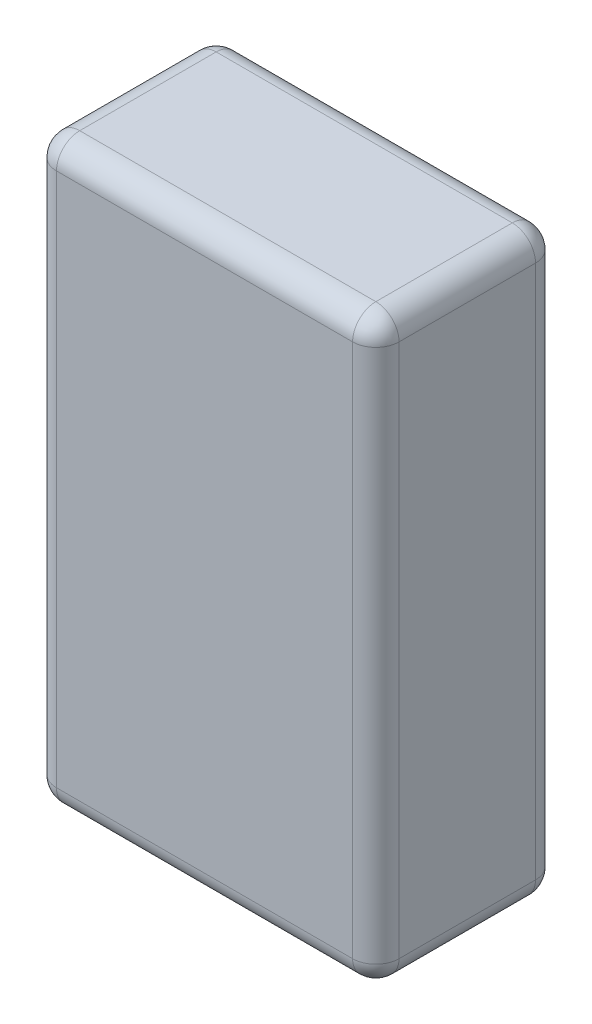
ISO-10303-21;
HEADER;
FILE_DESCRIPTION(('STEP AP214'),'2;1');
FILE_NAME('part.step','',(''),(''),'','','');
FILE_SCHEMA(('AUTOMOTIVE_DESIGN { 1 0 10303 214 1 1 1 1 }'));
ENDSEC;
DATA;
#1=APPLICATION_CONTEXT('core data for automotive mechanical design processes');
#2=APPLICATION_PROTOCOL_DEFINITION('international standard','automotive_design',2000,#1);
#3=PRODUCT_CONTEXT('',#1,'mechanical');
#4=PRODUCT('Part','Part','',(#3));
#5=PRODUCT_RELATED_PRODUCT_CATEGORY('part','',(#4));
#6=PRODUCT_DEFINITION_FORMATION('','',#4);
#7=PRODUCT_DEFINITION_CONTEXT('part definition',#1,'design');
#8=PRODUCT_DEFINITION('design','',#6,#7);
#9=PRODUCT_DEFINITION_SHAPE('','',#8);
#10=(LENGTH_UNIT() NAMED_UNIT(*) SI_UNIT(.MILLI.,.METRE.));
#11=(NAMED_UNIT(*) PLANE_ANGLE_UNIT() SI_UNIT($,.RADIAN.));
#12=(NAMED_UNIT(*) SI_UNIT($,.STERADIAN.) SOLID_ANGLE_UNIT());
#13=UNCERTAINTY_MEASURE_WITH_UNIT(LENGTH_MEASURE(1.E-05),#10,'distance_accuracy_value','');
#14=(GEOMETRIC_REPRESENTATION_CONTEXT(3) GLOBAL_UNCERTAINTY_ASSIGNED_CONTEXT((#13)) GLOBAL_UNIT_ASSIGNED_CONTEXT((#10,
#11,#12)) REPRESENTATION_CONTEXT('',''));
#15=CARTESIAN_POINT('',(0.,0.,0.));
#16=DIRECTION('',(0.,0.,1.));
#17=DIRECTION('',(1.,0.,0.));
#18=AXIS2_PLACEMENT_3D('',#15,#16,#17);
#19=CARTESIAN_POINT('',(0.,50.8,0.));
#20=DIRECTION('',(1.,0.,0.));
#21=DIRECTION('',(0.,0.,-1.));
#22=AXIS2_PLACEMENT_3D('',#19,#20,#21);
#23=PLANE('',#22);
#24=DIRECTION('',(0.,-1.,0.));
#25=VECTOR('',#24,1.);
#26=CARTESIAN_POINT('',(0.,50.8,-13.97));
#27=LINE('',#26,#25);
#28=CARTESIAN_POINT('',(0.,48.768,-13.97));
#29=VERTEX_POINT('',#28);
#30=CARTESIAN_POINT('',(0.,2.032,-13.97));
#31=VERTEX_POINT('',#30);
#32=EDGE_CURVE('E136',#29,#31,#27,.T.);
#33=ORIENTED_EDGE('',*,*,#32,.T.);
#34=DIRECTION('',(0.,0.,1.));
#35=VECTOR('',#34,1.);
#36=CARTESIAN_POINT('',(0.,2.032,0.));
#37=LINE('',#36,#35);
#38=CARTESIAN_POINT('',(0.,2.032,-2.032));
#39=VERTEX_POINT('',#38);
#40=EDGE_CURVE('E131',#31,#39,#37,.T.);
#41=ORIENTED_EDGE('',*,*,#40,.T.);
#42=DIRECTION('',(0.,-1.,0.));
#43=VECTOR('',#42,1.);
#44=CARTESIAN_POINT('',(0.,50.8,-2.032));
#45=LINE('',#44,#43);
#46=CARTESIAN_POINT('',(0.,48.768,-2.032));
#47=VERTEX_POINT('',#46);
#48=EDGE_CURVE('E126',#39,#47,#45,.F.);
#49=ORIENTED_EDGE('',*,*,#48,.T.);
#50=DIRECTION('',(0.,0.,1.));
#51=VECTOR('',#50,1.);
#52=CARTESIAN_POINT('',(0.,48.768,0.));
#53=LINE('',#52,#51);
#54=EDGE_CURVE('E128',#47,#29,#53,.F.);
#55=ORIENTED_EDGE('',*,*,#54,.T.);
#56=EDGE_LOOP('',(#33,#41,#49,#55));
#57=FACE_BOUND('',#56,.T.);
#58=ADVANCED_FACE('F37',(#57),#23,.F.);
#59=CARTESIAN_POINT('',(0.,50.8,0.));
#60=DIRECTION('',(0.,0.,-1.));
#61=DIRECTION('',(-1.,0.,0.));
#62=AXIS2_PLACEMENT_3D('',#59,#60,#61);
#63=PLANE('',#62);
#64=DIRECTION('',(0.,-1.,0.));
#65=VECTOR('',#64,1.);
#66=CARTESIAN_POINT('',(2.032,50.8,0.));
#67=LINE('',#66,#65);
#68=CARTESIAN_POINT('',(2.032,48.768,0.));
#69=VERTEX_POINT('',#68);
#70=CARTESIAN_POINT('',(2.032,2.032,0.));
#71=VERTEX_POINT('',#70);
#72=EDGE_CURVE('E160',#69,#71,#67,.T.);
#73=ORIENTED_EDGE('',*,*,#72,.T.);
#74=DIRECTION('',(1.,0.,0.));
#75=VECTOR('',#74,1.);
#76=CARTESIAN_POINT('',(29.972,2.032,0.));
#77=LINE('',#76,#75);
#78=CARTESIAN_POINT('',(27.94,2.032,0.));
#79=VERTEX_POINT('',#78);
#80=EDGE_CURVE('E261',#71,#79,#77,.T.);
#81=ORIENTED_EDGE('',*,*,#80,.T.);
#82=DIRECTION('',(0.,-1.,0.));
#83=VECTOR('',#82,1.);
#84=CARTESIAN_POINT('',(27.94,50.8,0.));
#85=LINE('',#84,#83);
#86=CARTESIAN_POINT('',(27.94,48.768,0.));
#87=VERTEX_POINT('',#86);
#88=EDGE_CURVE('E252',#79,#87,#85,.F.);
#89=ORIENTED_EDGE('',*,*,#88,.T.);
#90=DIRECTION('',(1.,0.,0.));
#91=VECTOR('',#90,1.);
#92=CARTESIAN_POINT('',(0.,48.768,0.));
#93=LINE('',#92,#91);
#94=EDGE_CURVE('E248',#87,#69,#93,.F.);
#95=ORIENTED_EDGE('',*,*,#94,.T.);
#96=EDGE_LOOP('',(#73,#81,#89,#95));
#97=FACE_BOUND('',#96,.T.);
#98=ADVANCED_FACE('F372',(#97),#63,.F.);
#99=CARTESIAN_POINT('',(29.972,50.8,0.));
#100=DIRECTION('',(-1.,0.,0.));
#101=DIRECTION('',(0.,0.,1.));
#102=AXIS2_PLACEMENT_3D('',#99,#100,#101);
#103=PLANE('',#102);
#104=DIRECTION('',(0.,0.,-1.));
#105=VECTOR('',#104,1.);
#106=CARTESIAN_POINT('',(29.972,2.032,-16.002));
#107=LINE('',#106,#105);
#108=CARTESIAN_POINT('',(29.972,2.032,-2.032));
#109=VERTEX_POINT('',#108);
#110=CARTESIAN_POINT('',(29.972,2.032,-13.97));
#111=VERTEX_POINT('',#110);
#112=EDGE_CURVE('E243',#109,#111,#107,.T.);
#113=ORIENTED_EDGE('',*,*,#112,.T.);
#114=DIRECTION('',(0.,-1.,0.));
#115=VECTOR('',#114,1.);
#116=CARTESIAN_POINT('',(29.972,50.8,-13.97));
#117=LINE('',#116,#115);
#118=CARTESIAN_POINT('',(29.972,48.768,-13.97));
#119=VERTEX_POINT('',#118);
#120=EDGE_CURVE('E240',#111,#119,#117,.F.);
#121=ORIENTED_EDGE('',*,*,#120,.T.);
#122=DIRECTION('',(0.,0.,-1.));
#123=VECTOR('',#122,1.);
#124=CARTESIAN_POINT('',(29.972,48.768,0.));
#125=LINE('',#124,#123);
#126=CARTESIAN_POINT('',(29.972,48.768,-2.032));
#127=VERTEX_POINT('',#126);
#128=EDGE_CURVE('E232',#119,#127,#125,.F.);
#129=ORIENTED_EDGE('',*,*,#128,.T.);
#130=DIRECTION('',(0.,-1.,0.));
#131=VECTOR('',#130,1.);
#132=CARTESIAN_POINT('',(29.972,50.8,-2.032));
#133=LINE('',#132,#131);
#134=EDGE_CURVE('E236',#127,#109,#133,.T.);
#135=ORIENTED_EDGE('',*,*,#134,.T.);
#136=EDGE_LOOP('',(#113,#121,#129,#135));
#137=FACE_BOUND('',#136,.T.);
#138=ADVANCED_FACE('F241',(#137),#103,.F.);
#139=CARTESIAN_POINT('',(0.,50.8,-16.002));
#140=DIRECTION('',(0.,0.,1.));
#141=DIRECTION('',(1.,0.,0.));
#142=AXIS2_PLACEMENT_3D('',#139,#140,#141);
#143=PLANE('',#142);
#144=DIRECTION('',(-1.,0.,0.));
#145=VECTOR('',#144,1.);
#146=CARTESIAN_POINT('',(0.,2.032,-16.002));
#147=LINE('',#146,#145);
#148=CARTESIAN_POINT('',(27.94,2.032,-16.002));
#149=VERTEX_POINT('',#148);
#150=CARTESIAN_POINT('',(2.032,2.032,-16.002));
#151=VERTEX_POINT('',#150);
#152=EDGE_CURVE('E324',#149,#151,#147,.T.);
#153=ORIENTED_EDGE('',*,*,#152,.T.);
#154=DIRECTION('',(0.,-1.,0.));
#155=VECTOR('',#154,1.);
#156=CARTESIAN_POINT('',(2.032,50.8,-16.002));
#157=LINE('',#156,#155);
#158=CARTESIAN_POINT('',(2.032,48.768,-16.002));
#159=VERTEX_POINT('',#158);
#160=EDGE_CURVE('E237',#151,#159,#157,.F.);
#161=ORIENTED_EDGE('',*,*,#160,.T.);
#162=DIRECTION('',(-1.,0.,0.));
#163=VECTOR('',#162,1.);
#164=CARTESIAN_POINT('',(0.,48.768,-16.002));
#165=LINE('',#164,#163);
#166=CARTESIAN_POINT('',(27.94,48.768,-16.002));
#167=VERTEX_POINT('',#166);
#168=EDGE_CURVE('E315',#159,#167,#165,.F.);
#169=ORIENTED_EDGE('',*,*,#168,.T.);
#170=DIRECTION('',(0.,-1.,0.));
#171=VECTOR('',#170,1.);
#172=CARTESIAN_POINT('',(27.94,50.8,-16.002));
#173=LINE('',#172,#171);
#174=EDGE_CURVE('E318',#167,#149,#173,.T.);
#175=ORIENTED_EDGE('',*,*,#174,.T.);
#176=EDGE_LOOP('',(#153,#161,#169,#175));
#177=FACE_BOUND('',#176,.T.);
#178=ADVANCED_FACE('F356',(#177),#143,.F.);
#179=CARTESIAN_POINT('',(0.,50.8,0.));
#180=DIRECTION('',(0.,-1.,0.));
#181=DIRECTION('',(0.,0.,-1.));
#182=AXIS2_PLACEMENT_3D('',#179,#180,#181);
#183=PLANE('',#182);
#184=DIRECTION('',(0.,0.,-1.));
#185=VECTOR('',#184,1.);
#186=CARTESIAN_POINT('',(27.94,50.8,0.));
#187=LINE('',#186,#185);
#188=CARTESIAN_POINT('',(27.94,50.8,-2.032));
#189=VERTEX_POINT('',#188);
#190=CARTESIAN_POINT('',(27.94,50.8,-13.97));
#191=VERTEX_POINT('',#190);
#192=EDGE_CURVE('E47',#189,#191,#187,.T.);
#193=ORIENTED_EDGE('',*,*,#192,.T.);
#194=DIRECTION('',(-1.,0.,0.));
#195=VECTOR('',#194,1.);
#196=CARTESIAN_POINT('',(0.,50.8,-13.97));
#197=LINE('',#196,#195);
#198=CARTESIAN_POINT('',(2.032,50.8,-13.97));
#199=VERTEX_POINT('',#198);
#200=EDGE_CURVE('E11',#191,#199,#197,.T.);
#201=ORIENTED_EDGE('',*,*,#200,.T.);
#202=DIRECTION('',(0.,0.,1.));
#203=VECTOR('',#202,1.);
#204=CARTESIAN_POINT('',(2.032,50.8,0.));
#205=LINE('',#204,#203);
#206=CARTESIAN_POINT('',(2.032,50.8,-2.032));
#207=VERTEX_POINT('',#206);
#208=EDGE_CURVE('E264',#199,#207,#205,.T.);
#209=ORIENTED_EDGE('',*,*,#208,.T.);
#210=DIRECTION('',(1.,0.,0.));
#211=VECTOR('',#210,1.);
#212=CARTESIAN_POINT('',(0.,50.8,-2.032));
#213=LINE('',#212,#211);
#214=EDGE_CURVE('E58',#207,#189,#213,.T.);
#215=ORIENTED_EDGE('',*,*,#214,.T.);
#216=EDGE_LOOP('',(#193,#201,#209,#215));
#217=FACE_BOUND('',#216,.T.);
#218=ADVANCED_FACE('F535',(#217),#183,.F.);
#219=CARTESIAN_POINT('',(0.,0.,0.));
#220=DIRECTION('',(0.,-1.,0.));
#221=DIRECTION('',(0.,0.,-1.));
#222=AXIS2_PLACEMENT_3D('',#219,#220,#221);
#223=PLANE('',#222);
#224=DIRECTION('',(1.,0.,0.));
#225=VECTOR('',#224,1.);
#226=CARTESIAN_POINT('',(0.,0.,-2.032));
#227=LINE('',#226,#225);
#228=CARTESIAN_POINT('',(27.94,0.,-2.032));
#229=VERTEX_POINT('',#228);
#230=CARTESIAN_POINT('',(2.032,0.,-2.032));
#231=VERTEX_POINT('',#230);
#232=EDGE_CURVE('E310',#229,#231,#227,.F.);
#233=ORIENTED_EDGE('',*,*,#232,.T.);
#234=DIRECTION('',(0.,0.,1.));
#235=VECTOR('',#234,1.);
#236=CARTESIAN_POINT('',(2.032,0.,-16.002));
#237=LINE('',#236,#235);
#238=CARTESIAN_POINT('',(2.032,0.,-13.97));
#239=VERTEX_POINT('',#238);
#240=EDGE_CURVE('E304',#231,#239,#237,.F.);
#241=ORIENTED_EDGE('',*,*,#240,.T.);
#242=DIRECTION('',(-1.,0.,0.));
#243=VECTOR('',#242,1.);
#244=CARTESIAN_POINT('',(29.972,0.,-13.97));
#245=LINE('',#244,#243);
#246=CARTESIAN_POINT('',(27.94,0.,-13.97));
#247=VERTEX_POINT('',#246);
#248=EDGE_CURVE('E297',#239,#247,#245,.F.);
#249=ORIENTED_EDGE('',*,*,#248,.T.);
#250=DIRECTION('',(0.,0.,-1.));
#251=VECTOR('',#250,1.);
#252=CARTESIAN_POINT('',(27.94,0.,0.));
#253=LINE('',#252,#251);
#254=EDGE_CURVE('E305',#247,#229,#253,.F.);
#255=ORIENTED_EDGE('',*,*,#254,.T.);
#256=EDGE_LOOP('',(#233,#241,#249,#255));
#257=FACE_BOUND('',#256,.T.);
#258=ADVANCED_FACE('F308',(#257),#223,.T.);
#259=CARTESIAN_POINT('',(27.94,48.768,0.));
#260=DIRECTION('',(0.,0.,-1.));
#261=DIRECTION('',(-1.,0.,0.));
#262=AXIS2_PLACEMENT_3D('',#259,#260,#261);
#263=CYLINDRICAL_SURFACE('',#262,2.032);
#264=CARTESIAN_POINT('',(27.94,48.768,-13.97));
#265=DIRECTION('',(0.,0.,-1.));
#266=DIRECTION('',(-1.,0.,0.));
#267=AXIS2_PLACEMENT_3D('',#264,#265,#266);
#268=CIRCLE('',#267,2.032);
#269=EDGE_CURVE('E41',#191,#119,#268,.T.);
#270=ORIENTED_EDGE('',*,*,#269,.F.);
#271=ORIENTED_EDGE('',*,*,#192,.F.);
#272=CARTESIAN_POINT('',(27.94,48.768,-2.032));
#273=DIRECTION('',(0.,0.,1.));
#274=DIRECTION('',(1.,0.,0.));
#275=AXIS2_PLACEMENT_3D('',#272,#273,#274);
#276=CIRCLE('',#275,2.032);
#277=EDGE_CURVE('E215',#127,#189,#276,.T.);
#278=ORIENTED_EDGE('',*,*,#277,.F.);
#279=ORIENTED_EDGE('',*,*,#128,.F.);
#280=EDGE_LOOP('',(#270,#271,#278,#279));
#281=FACE_BOUND('',#280,.T.);
#282=ADVANCED_FACE('F39',(#281),#263,.T.);
#283=CARTESIAN_POINT('',(27.94,48.768,-13.97));
#284=DIRECTION('',(1.,0.,0.));
#285=DIRECTION('',(0.,0.,-1.));
#286=AXIS2_PLACEMENT_3D('',#283,#284,#285);
#287=SPHERICAL_SURFACE('',#286,2.032);
#288=CARTESIAN_POINT('',(27.94,48.768,-13.97));
#289=DIRECTION('',(1.,0.,0.));
#290=DIRECTION('',(0.,0.,-1.));
#291=AXIS2_PLACEMENT_3D('',#288,#289,#290);
#292=CIRCLE('',#291,2.032);
#293=EDGE_CURVE('E209',#191,#167,#292,.F.);
#294=ORIENTED_EDGE('',*,*,#293,.F.);
#295=ORIENTED_EDGE('',*,*,#269,.T.);
#296=CARTESIAN_POINT('',(27.94,48.768,-13.97));
#297=DIRECTION('',(0.,1.,0.));
#298=DIRECTION('',(0.,0.,1.));
#299=AXIS2_PLACEMENT_3D('',#296,#297,#298);
#300=CIRCLE('',#299,2.032);
#301=EDGE_CURVE('E213',#167,#119,#300,.F.);
#302=ORIENTED_EDGE('',*,*,#301,.F.);
#303=EDGE_LOOP('',(#294,#295,#302));
#304=FACE_BOUND('',#303,.T.);
#305=ADVANCED_FACE('F228',(#304),#287,.T.);
#306=CARTESIAN_POINT('',(27.94,48.768,-2.032));
#307=DIRECTION('',(0.,1.,0.));
#308=DIRECTION('',(0.,0.,1.));
#309=AXIS2_PLACEMENT_3D('',#306,#307,#308);
#310=SPHERICAL_SURFACE('',#309,2.032);
#311=CARTESIAN_POINT('',(27.94,48.768,-2.032));
#312=DIRECTION('',(0.,1.,0.));
#313=DIRECTION('',(0.,0.,1.));
#314=AXIS2_PLACEMENT_3D('',#311,#312,#313);
#315=CIRCLE('',#314,2.032);
#316=EDGE_CURVE('E201',#127,#87,#315,.F.);
#317=ORIENTED_EDGE('',*,*,#316,.F.);
#318=ORIENTED_EDGE('',*,*,#277,.T.);
#319=CARTESIAN_POINT('',(27.94,48.768,-2.032));
#320=DIRECTION('',(1.,0.,0.));
#321=DIRECTION('',(0.,0.,-1.));
#322=AXIS2_PLACEMENT_3D('',#319,#320,#321);
#323=CIRCLE('',#322,2.032);
#324=EDGE_CURVE('E205',#87,#189,#323,.F.);
#325=ORIENTED_EDGE('',*,*,#324,.F.);
#326=EDGE_LOOP('',(#317,#318,#325));
#327=FACE_BOUND('',#326,.T.);
#328=ADVANCED_FACE('F508',(#327),#310,.T.);
#329=CARTESIAN_POINT('',(27.94,50.8,-13.97));
#330=DIRECTION('',(0.,-1.,0.));
#331=DIRECTION('',(0.,0.,-1.));
#332=AXIS2_PLACEMENT_3D('',#329,#330,#331);
#333=CYLINDRICAL_SURFACE('',#332,2.032);
#334=ORIENTED_EDGE('',*,*,#301,.T.);
#335=ORIENTED_EDGE('',*,*,#120,.F.);
#336=CARTESIAN_POINT('',(27.94,2.032,-13.97));
#337=DIRECTION('',(0.,-1.,0.));
#338=DIRECTION('',(0.,0.,-1.));
#339=AXIS2_PLACEMENT_3D('',#336,#337,#338);
#340=CIRCLE('',#339,2.032);
#341=EDGE_CURVE('E193',#149,#111,#340,.T.);
#342=ORIENTED_EDGE('',*,*,#341,.F.);
#343=ORIENTED_EDGE('',*,*,#174,.F.);
#344=EDGE_LOOP('',(#334,#335,#342,#343));
#345=FACE_BOUND('',#344,.T.);
#346=ADVANCED_FACE('F358',(#345),#333,.T.);
#347=CARTESIAN_POINT('',(0.,48.768,-13.97));
#348=DIRECTION('',(-1.,0.,0.));
#349=DIRECTION('',(0.,0.,1.));
#350=AXIS2_PLACEMENT_3D('',#347,#348,#349);
#351=CYLINDRICAL_SURFACE('',#350,2.032);
#352=ORIENTED_EDGE('',*,*,#293,.T.);
#353=ORIENTED_EDGE('',*,*,#168,.F.);
#354=CARTESIAN_POINT('',(2.032,48.768,-13.97));
#355=DIRECTION('',(-1.,0.,0.));
#356=DIRECTION('',(0.,0.,1.));
#357=AXIS2_PLACEMENT_3D('',#354,#355,#356);
#358=CIRCLE('',#357,2.032);
#359=EDGE_CURVE('E189',#199,#159,#358,.T.);
#360=ORIENTED_EDGE('',*,*,#359,.F.);
#361=ORIENTED_EDGE('',*,*,#200,.F.);
#362=EDGE_LOOP('',(#352,#353,#360,#361));
#363=FACE_BOUND('',#362,.T.);
#364=ADVANCED_FACE('F492',(#363),#351,.T.);
#365=CARTESIAN_POINT('',(2.032,48.768,0.));
#366=DIRECTION('',(0.,0.,1.));
#367=DIRECTION('',(1.,0.,0.));
#368=AXIS2_PLACEMENT_3D('',#365,#366,#367);
#369=CYLINDRICAL_SURFACE('',#368,2.032);
#370=CARTESIAN_POINT('',(2.032,48.768,-2.032));
#371=DIRECTION('',(0.,0.,1.));
#372=DIRECTION('',(1.,0.,0.));
#373=AXIS2_PLACEMENT_3D('',#370,#371,#372);
#374=CIRCLE('',#373,2.032);
#375=EDGE_CURVE('E143',#207,#47,#374,.T.);
#376=ORIENTED_EDGE('',*,*,#375,.F.);
#377=ORIENTED_EDGE('',*,*,#208,.F.);
#378=CARTESIAN_POINT('',(2.032,48.768,-13.97));
#379=DIRECTION('',(0.,0.,-1.));
#380=DIRECTION('',(-1.,0.,0.));
#381=AXIS2_PLACEMENT_3D('',#378,#379,#380);
#382=CIRCLE('',#381,2.032);
#383=EDGE_CURVE('E145',#29,#199,#382,.T.);
#384=ORIENTED_EDGE('',*,*,#383,.F.);
#385=ORIENTED_EDGE('',*,*,#54,.F.);
#386=EDGE_LOOP('',(#376,#377,#384,#385));
#387=FACE_BOUND('',#386,.T.);
#388=ADVANCED_FACE('F141',(#387),#369,.T.);
#389=CARTESIAN_POINT('',(0.,48.768,-2.032));
#390=DIRECTION('',(1.,0.,0.));
#391=DIRECTION('',(0.,0.,-1.));
#392=AXIS2_PLACEMENT_3D('',#389,#390,#391);
#393=CYLINDRICAL_SURFACE('',#392,2.032);
#394=ORIENTED_EDGE('',*,*,#324,.T.);
#395=ORIENTED_EDGE('',*,*,#214,.F.);
#396=CARTESIAN_POINT('',(2.032,48.768,-2.032));
#397=DIRECTION('',(-1.,0.,0.));
#398=DIRECTION('',(0.,0.,1.));
#399=AXIS2_PLACEMENT_3D('',#396,#397,#398);
#400=CIRCLE('',#399,2.032);
#401=EDGE_CURVE('E155',#69,#207,#400,.T.);
#402=ORIENTED_EDGE('',*,*,#401,.F.);
#403=ORIENTED_EDGE('',*,*,#94,.F.);
#404=EDGE_LOOP('',(#394,#395,#402,#403));
#405=FACE_BOUND('',#404,.T.);
#406=ADVANCED_FACE('F476',(#405),#393,.T.);
#407=CARTESIAN_POINT('',(27.94,50.8,-2.032));
#408=DIRECTION('',(0.,-1.,0.));
#409=DIRECTION('',(0.,0.,-1.));
#410=AXIS2_PLACEMENT_3D('',#407,#408,#409);
#411=CYLINDRICAL_SURFACE('',#410,2.032);
#412=ORIENTED_EDGE('',*,*,#316,.T.);
#413=ORIENTED_EDGE('',*,*,#88,.F.);
#414=CARTESIAN_POINT('',(27.94,2.032,-2.032));
#415=DIRECTION('',(0.,-1.,0.));
#416=DIRECTION('',(0.,0.,-1.));
#417=AXIS2_PLACEMENT_3D('',#414,#415,#416);
#418=CIRCLE('',#417,2.032);
#419=EDGE_CURVE('E181',#109,#79,#418,.T.);
#420=ORIENTED_EDGE('',*,*,#419,.F.);
#421=ORIENTED_EDGE('',*,*,#134,.F.);
#422=EDGE_LOOP('',(#412,#413,#420,#421));
#423=FACE_BOUND('',#422,.T.);
#424=ADVANCED_FACE('F338',(#423),#411,.T.);
#425=CARTESIAN_POINT('',(27.94,2.032,0.));
#426=DIRECTION('',(0.,0.,1.));
#427=DIRECTION('',(1.,0.,0.));
#428=AXIS2_PLACEMENT_3D('',#425,#426,#427);
#429=CYLINDRICAL_SURFACE('',#428,2.032);
#430=CARTESIAN_POINT('',(27.94,2.032,-13.97));
#431=DIRECTION('',(0.,0.,-1.));
#432=DIRECTION('',(-1.,0.,0.));
#433=AXIS2_PLACEMENT_3D('',#430,#431,#432);
#434=CIRCLE('',#433,2.032);
#435=EDGE_CURVE('E197',#111,#247,#434,.T.);
#436=ORIENTED_EDGE('',*,*,#435,.F.);
#437=ORIENTED_EDGE('',*,*,#112,.F.);
#438=CARTESIAN_POINT('',(27.94,2.032,-2.032));
#439=DIRECTION('',(0.,0.,1.));
#440=DIRECTION('',(1.,0.,0.));
#441=AXIS2_PLACEMENT_3D('',#438,#439,#440);
#442=CIRCLE('',#441,2.032);
#443=EDGE_CURVE('E177',#229,#109,#442,.T.);
#444=ORIENTED_EDGE('',*,*,#443,.F.);
#445=ORIENTED_EDGE('',*,*,#254,.F.);
#446=EDGE_LOOP('',(#436,#437,#444,#445));
#447=FACE_BOUND('',#446,.T.);
#448=ADVANCED_FACE('F335',(#447),#429,.T.);
#449=CARTESIAN_POINT('',(27.94,2.032,-13.97));
#450=DIRECTION('',(1.,0.,0.));
#451=DIRECTION('',(0.,1.,0.));
#452=AXIS2_PLACEMENT_3D('',#449,#450,#451);
#453=SPHERICAL_SURFACE('',#452,2.032);
#454=ORIENTED_EDGE('',*,*,#341,.T.);
#455=ORIENTED_EDGE('',*,*,#435,.T.);
#456=CARTESIAN_POINT('',(27.94,2.032,-13.97));
#457=DIRECTION('',(1.,0.,0.));
#458=DIRECTION('',(0.,0.,-1.));
#459=AXIS2_PLACEMENT_3D('',#456,#457,#458);
#460=CIRCLE('',#459,2.032);
#461=EDGE_CURVE('E167',#149,#247,#460,.F.);
#462=ORIENTED_EDGE('',*,*,#461,.F.);
#463=EDGE_LOOP('',(#454,#455,#462));
#464=FACE_BOUND('',#463,.T.);
#465=ADVANCED_FACE('F360',(#464),#453,.T.);
#466=CARTESIAN_POINT('',(2.032,48.768,-13.97));
#467=DIRECTION('',(0.,1.,0.));
#468=DIRECTION('',(0.,0.,1.));
#469=AXIS2_PLACEMENT_3D('',#466,#467,#468);
#470=SPHERICAL_SURFACE('',#469,2.032);
#471=ORIENTED_EDGE('',*,*,#383,.T.);
#472=ORIENTED_EDGE('',*,*,#359,.T.);
#473=CARTESIAN_POINT('',(2.032,48.768,-13.97));
#474=DIRECTION('',(0.,1.,0.));
#475=DIRECTION('',(0.,0.,1.));
#476=AXIS2_PLACEMENT_3D('',#473,#474,#475);
#477=CIRCLE('',#476,2.032);
#478=EDGE_CURVE('E162',#29,#159,#477,.F.);
#479=ORIENTED_EDGE('',*,*,#478,.F.);
#480=EDGE_LOOP('',(#471,#472,#479));
#481=FACE_BOUND('',#480,.T.);
#482=ADVANCED_FACE('F362',(#481),#470,.T.);
#483=CARTESIAN_POINT('',(2.032,48.768,-2.032));
#484=DIRECTION('',(0.,1.,0.));
#485=DIRECTION('',(0.,0.,1.));
#486=AXIS2_PLACEMENT_3D('',#483,#484,#485);
#487=SPHERICAL_SURFACE('',#486,2.032);
#488=ORIENTED_EDGE('',*,*,#401,.T.);
#489=ORIENTED_EDGE('',*,*,#375,.T.);
#490=CARTESIAN_POINT('',(2.032,48.768,-2.032));
#491=DIRECTION('',(0.,1.,0.));
#492=DIRECTION('',(0.,0.,1.));
#493=AXIS2_PLACEMENT_3D('',#490,#491,#492);
#494=CIRCLE('',#493,2.032);
#495=EDGE_CURVE('E152',#69,#47,#494,.F.);
#496=ORIENTED_EDGE('',*,*,#495,.F.);
#497=EDGE_LOOP('',(#488,#489,#496));
#498=FACE_BOUND('',#497,.T.);
#499=ADVANCED_FACE('F151',(#498),#487,.T.);
#500=CARTESIAN_POINT('',(27.94,2.032,-2.032));
#501=DIRECTION('',(1.,0.,0.));
#502=DIRECTION('',(0.,1.,0.));
#503=AXIS2_PLACEMENT_3D('',#500,#501,#502);
#504=SPHERICAL_SURFACE('',#503,2.032);
#505=ORIENTED_EDGE('',*,*,#443,.T.);
#506=ORIENTED_EDGE('',*,*,#419,.T.);
#507=CARTESIAN_POINT('',(27.94,2.032,-2.032));
#508=DIRECTION('',(1.,0.,0.));
#509=DIRECTION('',(0.,0.,-1.));
#510=AXIS2_PLACEMENT_3D('',#507,#508,#509);
#511=CIRCLE('',#510,2.032);
#512=EDGE_CURVE('E163',#229,#79,#511,.F.);
#513=ORIENTED_EDGE('',*,*,#512,.F.);
#514=EDGE_LOOP('',(#505,#506,#513));
#515=FACE_BOUND('',#514,.T.);
#516=ADVANCED_FACE('F340',(#515),#504,.T.);
#517=CARTESIAN_POINT('',(0.,2.032,-13.97));
#518=DIRECTION('',(1.,0.,0.));
#519=DIRECTION('',(0.,0.,-1.));
#520=AXIS2_PLACEMENT_3D('',#517,#518,#519);
#521=CYLINDRICAL_SURFACE('',#520,2.032);
#522=ORIENTED_EDGE('',*,*,#461,.T.);
#523=ORIENTED_EDGE('',*,*,#248,.F.);
#524=CARTESIAN_POINT('',(2.032,2.032,-13.97));
#525=DIRECTION('',(-1.,0.,0.));
#526=DIRECTION('',(0.,0.,1.));
#527=AXIS2_PLACEMENT_3D('',#524,#525,#526);
#528=CIRCLE('',#527,2.032);
#529=EDGE_CURVE('E170',#151,#239,#528,.T.);
#530=ORIENTED_EDGE('',*,*,#529,.F.);
#531=ORIENTED_EDGE('',*,*,#152,.F.);
#532=EDGE_LOOP('',(#522,#523,#530,#531));
#533=FACE_BOUND('',#532,.T.);
#534=ADVANCED_FACE('F299',(#533),#521,.T.);
#535=CARTESIAN_POINT('',(2.032,50.8,-13.97));
#536=DIRECTION('',(0.,-1.,0.));
#537=DIRECTION('',(0.,0.,-1.));
#538=AXIS2_PLACEMENT_3D('',#535,#536,#537);
#539=CYLINDRICAL_SURFACE('',#538,2.032);
#540=ORIENTED_EDGE('',*,*,#478,.T.);
#541=ORIENTED_EDGE('',*,*,#160,.F.);
#542=CARTESIAN_POINT('',(2.032,2.032,-13.97));
#543=DIRECTION('',(0.,-1.,0.));
#544=DIRECTION('',(0.,0.,-1.));
#545=AXIS2_PLACEMENT_3D('',#542,#543,#544);
#546=CIRCLE('',#545,2.032);
#547=EDGE_CURVE('E284',#31,#151,#546,.T.);
#548=ORIENTED_EDGE('',*,*,#547,.F.);
#549=ORIENTED_EDGE('',*,*,#32,.F.);
#550=EDGE_LOOP('',(#540,#541,#548,#549));
#551=FACE_BOUND('',#550,.T.);
#552=ADVANCED_FACE('F354',(#551),#539,.T.);
#553=CARTESIAN_POINT('',(2.032,50.8,-2.032));
#554=DIRECTION('',(0.,-1.,0.));
#555=DIRECTION('',(0.,0.,-1.));
#556=AXIS2_PLACEMENT_3D('',#553,#554,#555);
#557=CYLINDRICAL_SURFACE('',#556,2.032);
#558=ORIENTED_EDGE('',*,*,#495,.T.);
#559=ORIENTED_EDGE('',*,*,#48,.F.);
#560=CARTESIAN_POINT('',(2.032,2.032,-2.032));
#561=DIRECTION('',(0.,-1.,0.));
#562=DIRECTION('',(0.,0.,-1.));
#563=AXIS2_PLACEMENT_3D('',#560,#561,#562);
#564=CIRCLE('',#563,2.032);
#565=EDGE_CURVE('E280',#71,#39,#564,.T.);
#566=ORIENTED_EDGE('',*,*,#565,.F.);
#567=ORIENTED_EDGE('',*,*,#72,.F.);
#568=EDGE_LOOP('',(#558,#559,#566,#567));
#569=FACE_BOUND('',#568,.T.);
#570=ADVANCED_FACE('F158',(#569),#557,.T.);
#571=CARTESIAN_POINT('',(0.,2.032,-2.032));
#572=DIRECTION('',(-1.,0.,0.));
#573=DIRECTION('',(0.,0.,1.));
#574=AXIS2_PLACEMENT_3D('',#571,#572,#573);
#575=CYLINDRICAL_SURFACE('',#574,2.032);
#576=ORIENTED_EDGE('',*,*,#512,.T.);
#577=ORIENTED_EDGE('',*,*,#80,.F.);
#578=CARTESIAN_POINT('',(2.032,2.032,-2.032));
#579=DIRECTION('',(-1.,0.,0.));
#580=DIRECTION('',(0.,0.,1.));
#581=AXIS2_PLACEMENT_3D('',#578,#579,#580);
#582=CIRCLE('',#581,2.032);
#583=EDGE_CURVE('E277',#231,#71,#582,.T.);
#584=ORIENTED_EDGE('',*,*,#583,.F.);
#585=ORIENTED_EDGE('',*,*,#232,.F.);
#586=EDGE_LOOP('',(#576,#577,#584,#585));
#587=FACE_BOUND('',#586,.T.);
#588=ADVANCED_FACE('F343',(#587),#575,.T.);
#589=CARTESIAN_POINT('',(2.032,2.032,-13.97));
#590=DIRECTION('',(0.,0.,-1.));
#591=DIRECTION('',(0.,1.,0.));
#592=AXIS2_PLACEMENT_3D('',#589,#590,#591);
#593=SPHERICAL_SURFACE('',#592,2.032);
#594=ORIENTED_EDGE('',*,*,#547,.T.);
#595=ORIENTED_EDGE('',*,*,#529,.T.);
#596=CARTESIAN_POINT('',(2.032,2.032,-13.97));
#597=DIRECTION('',(0.,0.,-1.));
#598=DIRECTION('',(-1.,0.,0.));
#599=AXIS2_PLACEMENT_3D('',#596,#597,#598);
#600=CIRCLE('',#599,2.032);
#601=EDGE_CURVE('E274',#31,#239,#600,.F.);
#602=ORIENTED_EDGE('',*,*,#601,.F.);
#603=EDGE_LOOP('',(#594,#595,#602));
#604=FACE_BOUND('',#603,.T.);
#605=ADVANCED_FACE('F293',(#604),#593,.T.);
#606=CARTESIAN_POINT('',(2.032,2.032,-2.032));
#607=DIRECTION('',(0.,0.,1.));
#608=DIRECTION('',(0.,-1.,0.));
#609=AXIS2_PLACEMENT_3D('',#606,#607,#608);
#610=SPHERICAL_SURFACE('',#609,2.032);
#611=ORIENTED_EDGE('',*,*,#583,.T.);
#612=ORIENTED_EDGE('',*,*,#565,.T.);
#613=CARTESIAN_POINT('',(2.032,2.032,-2.032));
#614=DIRECTION('',(0.,0.,1.));
#615=DIRECTION('',(1.,0.,0.));
#616=AXIS2_PLACEMENT_3D('',#613,#614,#615);
#617=CIRCLE('',#616,2.032);
#618=EDGE_CURVE('E271',#231,#39,#617,.F.);
#619=ORIENTED_EDGE('',*,*,#618,.F.);
#620=EDGE_LOOP('',(#611,#612,#619));
#621=FACE_BOUND('',#620,.T.);
#622=ADVANCED_FACE('F384',(#621),#610,.T.);
#623=CARTESIAN_POINT('',(2.032,2.032,0.));
#624=DIRECTION('',(0.,0.,-1.));
#625=DIRECTION('',(-1.,0.,0.));
#626=AXIS2_PLACEMENT_3D('',#623,#624,#625);
#627=CYLINDRICAL_SURFACE('',#626,2.032);
#628=ORIENTED_EDGE('',*,*,#601,.T.);
#629=ORIENTED_EDGE('',*,*,#240,.F.);
#630=ORIENTED_EDGE('',*,*,#618,.T.);
#631=ORIENTED_EDGE('',*,*,#40,.F.);
#632=EDGE_LOOP('',(#628,#629,#630,#631));
#633=FACE_BOUND('',#632,.T.);
#634=ADVANCED_FACE('F381',(#633),#627,.T.);
#635=CLOSED_SHELL('',(#58,#98,#138,#178,#218,#258,#282,#305,#328,#346,#364,#388,#406,#424,#448,
#465,#482,#499,#516,#534,#552,#570,#588,#605,#622,#634));
#636=MANIFOLD_SOLID_BREP('B2',#635);
#637=ADVANCED_BREP_SHAPE_REPRESENTATION('',(#18,#636),#14);
#638=SHAPE_DEFINITION_REPRESENTATION(#9,#637);
ENDSEC;
END-ISO-10303-21;
